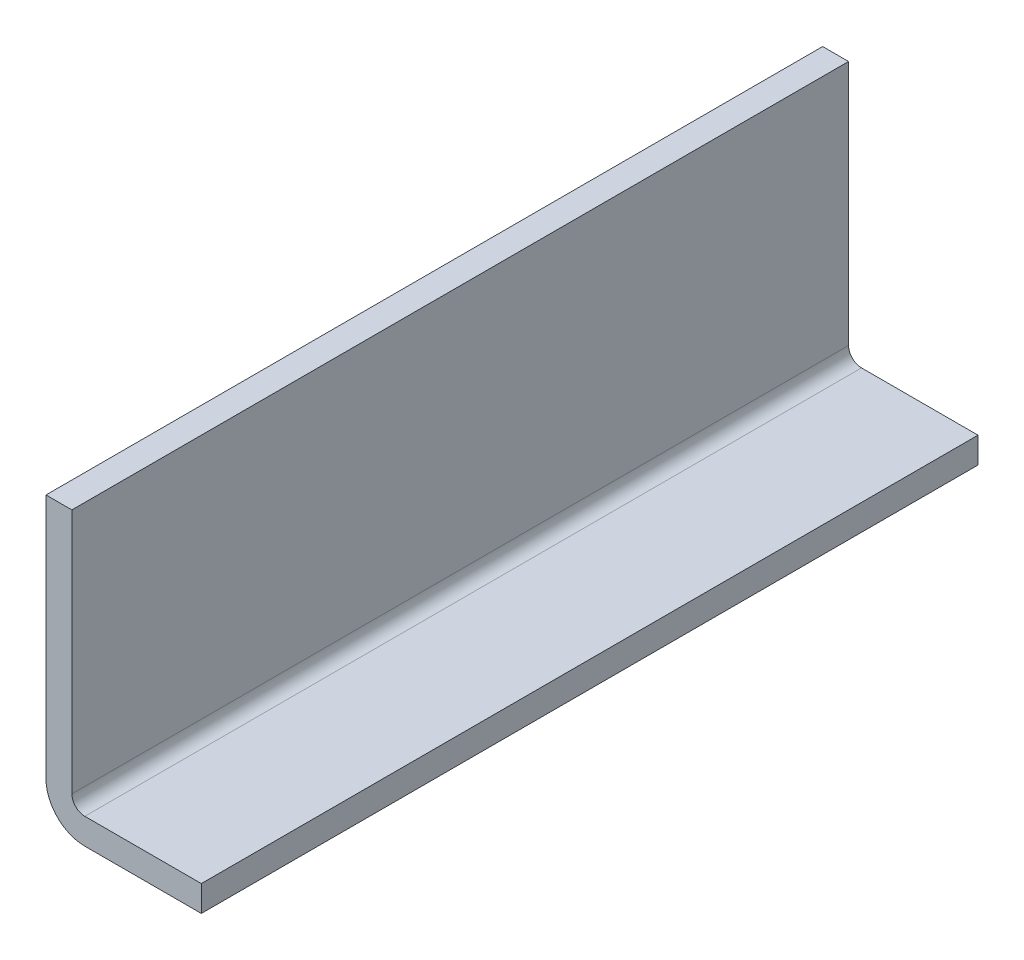
ISO-10303-21;
HEADER;
FILE_DESCRIPTION(('STEP AP214'),'2;1');
FILE_NAME('part.step','',(''),(''),'','','');
FILE_SCHEMA(('AUTOMOTIVE_DESIGN { 1 0 10303 214 1 1 1 1 }'));
ENDSEC;
DATA;
#1=APPLICATION_CONTEXT('core data for automotive mechanical design processes');
#2=APPLICATION_PROTOCOL_DEFINITION('international standard','automotive_design',2000,#1);
#3=PRODUCT_CONTEXT('',#1,'mechanical');
#4=PRODUCT('Part','Part','',(#3));
#5=PRODUCT_RELATED_PRODUCT_CATEGORY('part','',(#4));
#6=PRODUCT_DEFINITION_FORMATION('','',#4);
#7=PRODUCT_DEFINITION_CONTEXT('part definition',#1,'design');
#8=PRODUCT_DEFINITION('design','',#6,#7);
#9=PRODUCT_DEFINITION_SHAPE('','',#8);
#10=(LENGTH_UNIT() NAMED_UNIT(*) SI_UNIT(.MILLI.,.METRE.));
#11=(NAMED_UNIT(*) PLANE_ANGLE_UNIT() SI_UNIT($,.RADIAN.));
#12=(NAMED_UNIT(*) SI_UNIT($,.STERADIAN.) SOLID_ANGLE_UNIT());
#13=UNCERTAINTY_MEASURE_WITH_UNIT(LENGTH_MEASURE(1.E-05),#10,'distance_accuracy_value','');
#14=(GEOMETRIC_REPRESENTATION_CONTEXT(3) GLOBAL_UNCERTAINTY_ASSIGNED_CONTEXT((#13)) GLOBAL_UNIT_ASSIGNED_CONTEXT((#10,
#11,#12)) REPRESENTATION_CONTEXT('',''));
#15=CARTESIAN_POINT('',(0.,0.,0.));
#16=DIRECTION('',(0.,0.,1.));
#17=DIRECTION('',(1.,0.,0.));
#18=AXIS2_PLACEMENT_3D('',#15,#16,#17);
#19=CARTESIAN_POINT('',(-2.,20.,60.));
#20=DIRECTION('',(0.,-1.,0.));
#21=DIRECTION('',(0.,0.,-1.));
#22=AXIS2_PLACEMENT_3D('',#19,#20,#21);
#23=PLANE('',#22);
#24=DIRECTION('',(-1.,0.,0.));
#25=VECTOR('',#24,1.);
#26=CARTESIAN_POINT('',(-2.,20.,0.));
#27=LINE('',#26,#25);
#28=CARTESIAN_POINT('',(0.,20.,0.));
#29=VERTEX_POINT('',#28);
#30=CARTESIAN_POINT('',(-2.,20.,0.));
#31=VERTEX_POINT('',#30);
#32=EDGE_CURVE('E127',#29,#31,#27,.T.);
#33=ORIENTED_EDGE('',*,*,#32,.T.);
#34=DIRECTION('',(0.,0.,-1.));
#35=VECTOR('',#34,1.);
#36=CARTESIAN_POINT('',(-2.,20.,60.));
#37=LINE('',#36,#35);
#38=CARTESIAN_POINT('',(-2.,20.,60.));
#39=VERTEX_POINT('',#38);
#40=EDGE_CURVE('E11',#39,#31,#37,.T.);
#41=ORIENTED_EDGE('',*,*,#40,.F.);
#42=DIRECTION('',(-1.,0.,0.));
#43=VECTOR('',#42,1.);
#44=CARTESIAN_POINT('',(-2.,20.,60.));
#45=LINE('',#44,#43);
#46=CARTESIAN_POINT('',(0.,20.,60.));
#47=VERTEX_POINT('',#46);
#48=EDGE_CURVE('E141',#47,#39,#45,.T.);
#49=ORIENTED_EDGE('',*,*,#48,.F.);
#50=DIRECTION('',(0.,0.,-1.));
#51=VECTOR('',#50,1.);
#52=CARTESIAN_POINT('',(0.,20.,60.));
#53=LINE('',#52,#51);
#54=EDGE_CURVE('E123',#47,#29,#53,.T.);
#55=ORIENTED_EDGE('',*,*,#54,.T.);
#56=EDGE_LOOP('',(#33,#41,#49,#55));
#57=FACE_BOUND('',#56,.T.);
#58=ADVANCED_FACE('F31',(#57),#23,.F.);
#59=CARTESIAN_POINT('',(-2.,20.,60.));
#60=DIRECTION('',(1.,0.,0.));
#61=DIRECTION('',(0.,0.,-1.));
#62=AXIS2_PLACEMENT_3D('',#59,#60,#61);
#63=PLANE('',#62);
#64=DIRECTION('',(0.,-1.,0.));
#65=VECTOR('',#64,1.);
#66=CARTESIAN_POINT('',(-2.,20.,0.));
#67=LINE('',#66,#65);
#68=CARTESIAN_POINT('',(-2.,1.00000000000002,0.));
#69=VERTEX_POINT('',#68);
#70=EDGE_CURVE('E130',#31,#69,#67,.T.);
#71=ORIENTED_EDGE('',*,*,#70,.T.);
#72=DIRECTION('',(0.,0.,-1.));
#73=VECTOR('',#72,1.);
#74=CARTESIAN_POINT('',(-2.,1.00000000000002,60.));
#75=LINE('',#74,#73);
#76=CARTESIAN_POINT('',(-2.,1.00000000000002,60.));
#77=VERTEX_POINT('',#76);
#78=EDGE_CURVE('E39',#77,#69,#75,.T.);
#79=ORIENTED_EDGE('',*,*,#78,.F.);
#80=DIRECTION('',(0.,-1.,0.));
#81=VECTOR('',#80,1.);
#82=CARTESIAN_POINT('',(-2.,20.,60.));
#83=LINE('',#82,#81);
#84=EDGE_CURVE('E90',#39,#77,#83,.T.);
#85=ORIENTED_EDGE('',*,*,#84,.F.);
#86=ORIENTED_EDGE('',*,*,#40,.T.);
#87=EDGE_LOOP('',(#71,#79,#85,#86));
#88=FACE_BOUND('',#87,.T.);
#89=ADVANCED_FACE('F176',(#88),#63,.F.);
#90=CARTESIAN_POINT('',(1.,1.,60.));
#91=DIRECTION('',(0.,0.,-1.));
#92=DIRECTION('',(-1.,0.,0.));
#93=AXIS2_PLACEMENT_3D('',#90,#91,#92);
#94=CYLINDRICAL_SURFACE('',#93,3.);
#95=CARTESIAN_POINT('',(1.,1.,0.));
#96=DIRECTION('',(0.,0.,1.));
#97=DIRECTION('',(-1.,0.,0.));
#98=AXIS2_PLACEMENT_3D('',#95,#96,#97);
#99=CIRCLE('',#98,3.);
#100=CARTESIAN_POINT('',(1.00000000000002,-2.,0.));
#101=VERTEX_POINT('',#100);
#102=EDGE_CURVE('E132',#69,#101,#99,.T.);
#103=ORIENTED_EDGE('',*,*,#102,.T.);
#104=DIRECTION('',(0.,0.,-1.));
#105=VECTOR('',#104,1.);
#106=CARTESIAN_POINT('',(1.00000000000002,-2.,60.));
#107=LINE('',#106,#105);
#108=CARTESIAN_POINT('',(1.00000000000002,-2.,60.));
#109=VERTEX_POINT('',#108);
#110=EDGE_CURVE('E148',#109,#101,#107,.T.);
#111=ORIENTED_EDGE('',*,*,#110,.F.);
#112=CARTESIAN_POINT('',(1.,1.,60.));
#113=DIRECTION('',(0.,0.,1.));
#114=DIRECTION('',(-1.,0.,0.));
#115=AXIS2_PLACEMENT_3D('',#112,#113,#114);
#116=CIRCLE('',#115,3.);
#117=EDGE_CURVE('E156',#77,#109,#116,.T.);
#118=ORIENTED_EDGE('',*,*,#117,.F.);
#119=ORIENTED_EDGE('',*,*,#78,.T.);
#120=EDGE_LOOP('',(#103,#111,#118,#119));
#121=FACE_BOUND('',#120,.T.);
#122=ADVANCED_FACE('F154',(#121),#94,.T.);
#123=CARTESIAN_POINT('',(1.00000000000002,-2.,60.));
#124=DIRECTION('',(0.,1.,0.));
#125=DIRECTION('',(0.,0.,1.));
#126=AXIS2_PLACEMENT_3D('',#123,#124,#125);
#127=PLANE('',#126);
#128=DIRECTION('',(1.,0.,0.));
#129=VECTOR('',#128,1.);
#130=CARTESIAN_POINT('',(1.00000000000002,-2.,0.));
#131=LINE('',#130,#129);
#132=CARTESIAN_POINT('',(10.,-2.,0.));
#133=VERTEX_POINT('',#132);
#134=EDGE_CURVE('E134',#101,#133,#131,.T.);
#135=ORIENTED_EDGE('',*,*,#134,.T.);
#136=DIRECTION('',(0.,0.,-1.));
#137=VECTOR('',#136,1.);
#138=CARTESIAN_POINT('',(10.,-2.,60.));
#139=LINE('',#138,#137);
#140=CARTESIAN_POINT('',(10.,-2.,60.));
#141=VERTEX_POINT('',#140);
#142=EDGE_CURVE('E145',#141,#133,#139,.T.);
#143=ORIENTED_EDGE('',*,*,#142,.F.);
#144=DIRECTION('',(1.,0.,0.));
#145=VECTOR('',#144,1.);
#146=CARTESIAN_POINT('',(1.00000000000002,-2.,60.));
#147=LINE('',#146,#145);
#148=EDGE_CURVE('E168',#109,#141,#147,.T.);
#149=ORIENTED_EDGE('',*,*,#148,.F.);
#150=ORIENTED_EDGE('',*,*,#110,.T.);
#151=EDGE_LOOP('',(#135,#143,#149,#150));
#152=FACE_BOUND('',#151,.T.);
#153=ADVANCED_FACE('F164',(#152),#127,.F.);
#154=CARTESIAN_POINT('',(10.,0.,60.));
#155=DIRECTION('',(-1.,0.,0.));
#156=DIRECTION('',(0.,0.,1.));
#157=AXIS2_PLACEMENT_3D('',#154,#155,#156);
#158=PLANE('',#157);
#159=DIRECTION('',(0.,1.,0.));
#160=VECTOR('',#159,1.);
#161=CARTESIAN_POINT('',(10.,0.,0.));
#162=LINE('',#161,#160);
#163=CARTESIAN_POINT('',(10.,0.,0.));
#164=VERTEX_POINT('',#163);
#165=EDGE_CURVE('E136',#133,#164,#162,.T.);
#166=ORIENTED_EDGE('',*,*,#165,.T.);
#167=DIRECTION('',(0.,0.,-1.));
#168=VECTOR('',#167,1.);
#169=CARTESIAN_POINT('',(10.,0.,60.));
#170=LINE('',#169,#168);
#171=CARTESIAN_POINT('',(10.,0.,60.));
#172=VERTEX_POINT('',#171);
#173=EDGE_CURVE('E118',#172,#164,#170,.T.);
#174=ORIENTED_EDGE('',*,*,#173,.F.);
#175=DIRECTION('',(0.,1.,0.));
#176=VECTOR('',#175,1.);
#177=CARTESIAN_POINT('',(10.,0.,60.));
#178=LINE('',#177,#176);
#179=EDGE_CURVE('E109',#141,#172,#178,.T.);
#180=ORIENTED_EDGE('',*,*,#179,.F.);
#181=ORIENTED_EDGE('',*,*,#142,.T.);
#182=EDGE_LOOP('',(#166,#174,#180,#181));
#183=FACE_BOUND('',#182,.T.);
#184=ADVANCED_FACE('F167',(#183),#158,.F.);
#185=CARTESIAN_POINT('',(1.00000000000001,0.,60.));
#186=DIRECTION('',(0.,-1.,0.));
#187=DIRECTION('',(0.,0.,-1.));
#188=AXIS2_PLACEMENT_3D('',#185,#186,#187);
#189=PLANE('',#188);
#190=DIRECTION('',(-1.,0.,0.));
#191=VECTOR('',#190,1.);
#192=CARTESIAN_POINT('',(1.00000000000001,0.,0.));
#193=LINE('',#192,#191);
#194=CARTESIAN_POINT('',(1.00000000000001,0.,0.));
#195=VERTEX_POINT('',#194);
#196=EDGE_CURVE('E117',#164,#195,#193,.T.);
#197=ORIENTED_EDGE('',*,*,#196,.T.);
#198=DIRECTION('',(0.,0.,-1.));
#199=VECTOR('',#198,1.);
#200=CARTESIAN_POINT('',(1.00000000000001,0.,60.));
#201=LINE('',#200,#199);
#202=CARTESIAN_POINT('',(1.00000000000001,0.,60.));
#203=VERTEX_POINT('',#202);
#204=EDGE_CURVE('E114',#203,#195,#201,.T.);
#205=ORIENTED_EDGE('',*,*,#204,.F.);
#206=DIRECTION('',(-1.,0.,0.));
#207=VECTOR('',#206,1.);
#208=CARTESIAN_POINT('',(1.00000000000001,0.,60.));
#209=LINE('',#208,#207);
#210=EDGE_CURVE('E103',#172,#203,#209,.T.);
#211=ORIENTED_EDGE('',*,*,#210,.F.);
#212=ORIENTED_EDGE('',*,*,#173,.T.);
#213=EDGE_LOOP('',(#197,#205,#211,#212));
#214=FACE_BOUND('',#213,.T.);
#215=ADVANCED_FACE('F115',(#214),#189,.F.);
#216=CARTESIAN_POINT('',(1.,1.,60.));
#217=DIRECTION('',(0.,0.,-1.));
#218=DIRECTION('',(-1.,0.,0.));
#219=AXIS2_PLACEMENT_3D('',#216,#217,#218);
#220=CYLINDRICAL_SURFACE('',#219,1.);
#221=CARTESIAN_POINT('',(1.,1.,0.));
#222=DIRECTION('',(0.,0.,-1.));
#223=DIRECTION('',(1.,0.,0.));
#224=AXIS2_PLACEMENT_3D('',#221,#222,#223);
#225=CIRCLE('',#224,1.);
#226=CARTESIAN_POINT('',(0.,1.00000000000001,0.));
#227=VERTEX_POINT('',#226);
#228=EDGE_CURVE('E76',#195,#227,#225,.T.);
#229=ORIENTED_EDGE('',*,*,#228,.T.);
#230=DIRECTION('',(0.,0.,-1.));
#231=VECTOR('',#230,1.);
#232=CARTESIAN_POINT('',(0.,1.00000000000001,60.));
#233=LINE('',#232,#231);
#234=CARTESIAN_POINT('',(0.,1.00000000000001,60.));
#235=VERTEX_POINT('',#234);
#236=EDGE_CURVE('E119',#235,#227,#233,.T.);
#237=ORIENTED_EDGE('',*,*,#236,.F.);
#238=CARTESIAN_POINT('',(1.,1.,60.));
#239=DIRECTION('',(0.,0.,-1.));
#240=DIRECTION('',(1.,0.,0.));
#241=AXIS2_PLACEMENT_3D('',#238,#239,#240);
#242=CIRCLE('',#241,1.);
#243=EDGE_CURVE('E107',#203,#235,#242,.T.);
#244=ORIENTED_EDGE('',*,*,#243,.F.);
#245=ORIENTED_EDGE('',*,*,#204,.T.);
#246=EDGE_LOOP('',(#229,#237,#244,#245));
#247=FACE_BOUND('',#246,.T.);
#248=ADVANCED_FACE('F121',(#247),#220,.F.);
#249=CARTESIAN_POINT('',(0.,20.,60.));
#250=DIRECTION('',(-1.,0.,0.));
#251=DIRECTION('',(0.,-1.,0.));
#252=AXIS2_PLACEMENT_3D('',#249,#250,#251);
#253=PLANE('',#252);
#254=DIRECTION('',(0.,1.,0.));
#255=VECTOR('',#254,1.);
#256=CARTESIAN_POINT('',(0.,20.,0.));
#257=LINE('',#256,#255);
#258=EDGE_CURVE('E82',#227,#29,#257,.T.);
#259=ORIENTED_EDGE('',*,*,#258,.T.);
#260=ORIENTED_EDGE('',*,*,#54,.F.);
#261=DIRECTION('',(0.,1.,0.));
#262=VECTOR('',#261,1.);
#263=CARTESIAN_POINT('',(0.,20.,60.));
#264=LINE('',#263,#262);
#265=EDGE_CURVE('E47',#235,#47,#264,.T.);
#266=ORIENTED_EDGE('',*,*,#265,.F.);
#267=ORIENTED_EDGE('',*,*,#236,.T.);
#268=EDGE_LOOP('',(#259,#260,#266,#267));
#269=FACE_BOUND('',#268,.T.);
#270=ADVANCED_FACE('F192',(#269),#253,.F.);
#271=CARTESIAN_POINT('',(1.,1.,60.));
#272=DIRECTION('',(0.,0.,1.));
#273=DIRECTION('',(1.,0.,0.));
#274=AXIS2_PLACEMENT_3D('',#271,#272,#273);
#275=PLANE('',#274);
#276=ORIENTED_EDGE('',*,*,#48,.T.);
#277=ORIENTED_EDGE('',*,*,#84,.T.);
#278=ORIENTED_EDGE('',*,*,#117,.T.);
#279=ORIENTED_EDGE('',*,*,#148,.T.);
#280=ORIENTED_EDGE('',*,*,#179,.T.);
#281=ORIENTED_EDGE('',*,*,#210,.T.);
#282=ORIENTED_EDGE('',*,*,#243,.T.);
#283=ORIENTED_EDGE('',*,*,#265,.T.);
#284=EDGE_LOOP('',(#276,#277,#278,#279,#280,#281,#282,#283));
#285=FACE_BOUND('',#284,.T.);
#286=ADVANCED_FACE('F105',(#285),#275,.T.);
#287=CARTESIAN_POINT('',(1.,1.,0.));
#288=DIRECTION('',(0.,0.,1.));
#289=DIRECTION('',(1.,0.,0.));
#290=AXIS2_PLACEMENT_3D('',#287,#288,#289);
#291=PLANE('',#290);
#292=ORIENTED_EDGE('',*,*,#32,.F.);
#293=ORIENTED_EDGE('',*,*,#258,.F.);
#294=ORIENTED_EDGE('',*,*,#228,.F.);
#295=ORIENTED_EDGE('',*,*,#196,.F.);
#296=ORIENTED_EDGE('',*,*,#165,.F.);
#297=ORIENTED_EDGE('',*,*,#134,.F.);
#298=ORIENTED_EDGE('',*,*,#102,.F.);
#299=ORIENTED_EDGE('',*,*,#70,.F.);
#300=EDGE_LOOP('',(#292,#293,#294,#295,#296,#297,#298,#299));
#301=FACE_BOUND('',#300,.T.);
#302=ADVANCED_FACE('F160',(#301),#291,.F.);
#303=CLOSED_SHELL('',(#58,#89,#122,#153,#184,#215,#248,#270,#286,#302));
#304=MANIFOLD_SOLID_BREP('B2',#303);
#305=ADVANCED_BREP_SHAPE_REPRESENTATION('',(#18,#304),#14);
#306=SHAPE_DEFINITION_REPRESENTATION(#9,#305);
ENDSEC;
END-ISO-10303-21;
